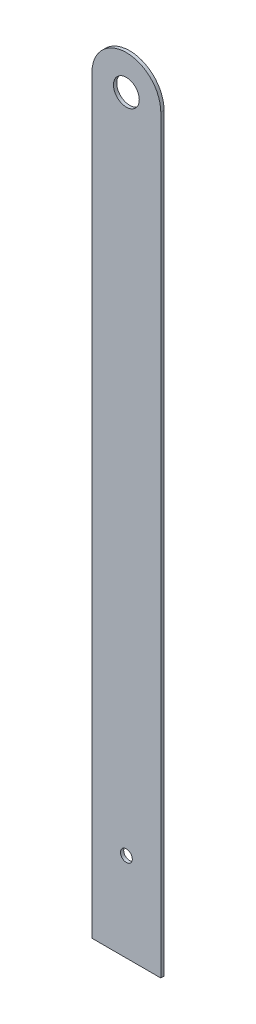
ISO-10303-21;
HEADER;
FILE_DESCRIPTION(('STEP AP214'),'2;1');
FILE_NAME('part.step','',(''),(''),'','','');
FILE_SCHEMA(('AUTOMOTIVE_DESIGN { 1 0 10303 214 1 1 1 1 }'));
ENDSEC;
DATA;
#1=APPLICATION_CONTEXT('core data for automotive mechanical design processes');
#2=APPLICATION_PROTOCOL_DEFINITION('international standard','automotive_design',2000,#1);
#3=PRODUCT_CONTEXT('',#1,'mechanical');
#4=PRODUCT('Part','Part','',(#3));
#5=PRODUCT_RELATED_PRODUCT_CATEGORY('part','',(#4));
#6=PRODUCT_DEFINITION_FORMATION('','',#4);
#7=PRODUCT_DEFINITION_CONTEXT('part definition',#1,'design');
#8=PRODUCT_DEFINITION('design','',#6,#7);
#9=PRODUCT_DEFINITION_SHAPE('','',#8);
#10=(LENGTH_UNIT() NAMED_UNIT(*) SI_UNIT(.MILLI.,.METRE.));
#11=(NAMED_UNIT(*) PLANE_ANGLE_UNIT() SI_UNIT($,.RADIAN.));
#12=(NAMED_UNIT(*) SI_UNIT($,.STERADIAN.) SOLID_ANGLE_UNIT());
#13=UNCERTAINTY_MEASURE_WITH_UNIT(LENGTH_MEASURE(1.E-05),#10,'distance_accuracy_value','');
#14=(GEOMETRIC_REPRESENTATION_CONTEXT(3) GLOBAL_UNCERTAINTY_ASSIGNED_CONTEXT((#13)) GLOBAL_UNIT_ASSIGNED_CONTEXT((#10,
#11,#12)) REPRESENTATION_CONTEXT('',''));
#15=CARTESIAN_POINT('',(0.,0.,0.));
#16=DIRECTION('',(0.,0.,1.));
#17=DIRECTION('',(1.,0.,0.));
#18=AXIS2_PLACEMENT_3D('',#15,#16,#17);
#19=CARTESIAN_POINT('',(12.7,0.,1.2));
#20=DIRECTION('',(1.,0.,0.));
#21=DIRECTION('',(0.,1.,0.));
#22=AXIS2_PLACEMENT_3D('',#19,#20,#21);
#23=PLANE('',#22);
#24=DIRECTION('',(0.,-1.,0.));
#25=VECTOR('',#24,1.);
#26=CARTESIAN_POINT('',(12.7,0.,0.));
#27=LINE('',#26,#25);
#28=CARTESIAN_POINT('',(12.7,138.43,0.));
#29=VERTEX_POINT('',#28);
#30=CARTESIAN_POINT('',(12.7,-138.43,0.));
#31=VERTEX_POINT('',#30);
#32=EDGE_CURVE('E99',#29,#31,#27,.T.);
#33=ORIENTED_EDGE('',*,*,#32,.F.);
#34=DIRECTION('',(0.,0.,-1.));
#35=VECTOR('',#34,1.);
#36=CARTESIAN_POINT('',(12.7,138.43,1.2));
#37=LINE('',#36,#35);
#38=CARTESIAN_POINT('',(12.7,138.43,1.2));
#39=VERTEX_POINT('',#38);
#40=EDGE_CURVE('E11',#39,#29,#37,.T.);
#41=ORIENTED_EDGE('',*,*,#40,.F.);
#42=DIRECTION('',(0.,-1.,0.));
#43=VECTOR('',#42,1.);
#44=CARTESIAN_POINT('',(12.7,0.,1.2));
#45=LINE('',#44,#43);
#46=CARTESIAN_POINT('',(12.7,-138.43,1.2));
#47=VERTEX_POINT('',#46);
#48=EDGE_CURVE('E92',#39,#47,#45,.T.);
#49=ORIENTED_EDGE('',*,*,#48,.T.);
#50=DIRECTION('',(0.,0.,-1.));
#51=VECTOR('',#50,1.);
#52=CARTESIAN_POINT('',(12.7,-138.43,1.2));
#53=LINE('',#52,#51);
#54=EDGE_CURVE('E73',#47,#31,#53,.T.);
#55=ORIENTED_EDGE('',*,*,#54,.T.);
#56=EDGE_LOOP('',(#33,#41,#49,#55));
#57=FACE_BOUND('',#56,.T.);
#58=ADVANCED_FACE('F35',(#57),#23,.T.);
#59=CARTESIAN_POINT('',(0.,138.43,1.2));
#60=DIRECTION('',(0.,0.,-1.));
#61=DIRECTION('',(-1.,0.,0.));
#62=AXIS2_PLACEMENT_3D('',#59,#60,#61);
#63=CYLINDRICAL_SURFACE('',#62,12.7);
#64=CARTESIAN_POINT('',(0.,138.43,0.));
#65=DIRECTION('',(0.,0.,1.));
#66=DIRECTION('',(1.,0.,0.));
#67=AXIS2_PLACEMENT_3D('',#64,#65,#66);
#68=CIRCLE('',#67,12.7);
#69=CARTESIAN_POINT('',(-12.7,138.43,0.));
#70=VERTEX_POINT('',#69);
#71=EDGE_CURVE('E86',#70,#29,#68,.F.);
#72=ORIENTED_EDGE('',*,*,#71,.F.);
#73=DIRECTION('',(0.,0.,-1.));
#74=VECTOR('',#73,1.);
#75=CARTESIAN_POINT('',(-12.7,138.43,1.2));
#76=LINE('',#75,#74);
#77=CARTESIAN_POINT('',(-12.7,138.43,1.2));
#78=VERTEX_POINT('',#77);
#79=EDGE_CURVE('E43',#78,#70,#76,.T.);
#80=ORIENTED_EDGE('',*,*,#79,.F.);
#81=CARTESIAN_POINT('',(0.,138.43,1.2));
#82=DIRECTION('',(0.,0.,1.));
#83=DIRECTION('',(1.,0.,0.));
#84=AXIS2_PLACEMENT_3D('',#81,#82,#83);
#85=CIRCLE('',#84,12.7);
#86=EDGE_CURVE('E84',#78,#39,#85,.F.);
#87=ORIENTED_EDGE('',*,*,#86,.T.);
#88=ORIENTED_EDGE('',*,*,#40,.T.);
#89=EDGE_LOOP('',(#72,#80,#87,#88));
#90=FACE_BOUND('',#89,.T.);
#91=ADVANCED_FACE('F82',(#90),#63,.T.);
#92=CARTESIAN_POINT('',(-12.7,0.,1.2));
#93=DIRECTION('',(1.,0.,0.));
#94=DIRECTION('',(0.,1.,0.));
#95=AXIS2_PLACEMENT_3D('',#92,#93,#94);
#96=PLANE('',#95);
#97=DIRECTION('',(0.,-1.,0.));
#98=VECTOR('',#97,1.);
#99=CARTESIAN_POINT('',(-12.7,0.,0.));
#100=LINE('',#99,#98);
#101=CARTESIAN_POINT('',(-12.7,-138.43,0.));
#102=VERTEX_POINT('',#101);
#103=EDGE_CURVE('E66',#70,#102,#100,.T.);
#104=ORIENTED_EDGE('',*,*,#103,.T.);
#105=DIRECTION('',(0.,0.,-1.));
#106=VECTOR('',#105,1.);
#107=CARTESIAN_POINT('',(-12.7,-138.43,1.2));
#108=LINE('',#107,#106);
#109=CARTESIAN_POINT('',(-12.7,-138.43,1.2));
#110=VERTEX_POINT('',#109);
#111=EDGE_CURVE('E87',#110,#102,#108,.T.);
#112=ORIENTED_EDGE('',*,*,#111,.F.);
#113=DIRECTION('',(0.,-1.,0.));
#114=VECTOR('',#113,1.);
#115=CARTESIAN_POINT('',(-12.7,0.,1.2));
#116=LINE('',#115,#114);
#117=EDGE_CURVE('E88',#78,#110,#116,.T.);
#118=ORIENTED_EDGE('',*,*,#117,.F.);
#119=ORIENTED_EDGE('',*,*,#79,.T.);
#120=EDGE_LOOP('',(#104,#112,#118,#119));
#121=FACE_BOUND('',#120,.T.);
#122=ADVANCED_FACE('F89',(#121),#96,.F.);
#123=CARTESIAN_POINT('',(0.,-138.43,1.2));
#124=DIRECTION('',(0.,1.,0.));
#125=DIRECTION('',(0.,0.,1.));
#126=AXIS2_PLACEMENT_3D('',#123,#124,#125);
#127=PLANE('',#126);
#128=DIRECTION('',(1.,0.,0.));
#129=VECTOR('',#128,1.);
#130=CARTESIAN_POINT('',(0.,-138.43,0.));
#131=LINE('',#130,#129);
#132=EDGE_CURVE('E94',#102,#31,#131,.T.);
#133=ORIENTED_EDGE('',*,*,#132,.T.);
#134=ORIENTED_EDGE('',*,*,#54,.F.);
#135=DIRECTION('',(1.,0.,0.));
#136=VECTOR('',#135,1.);
#137=CARTESIAN_POINT('',(0.,-138.43,1.2));
#138=LINE('',#137,#136);
#139=EDGE_CURVE('E51',#110,#47,#138,.T.);
#140=ORIENTED_EDGE('',*,*,#139,.F.);
#141=ORIENTED_EDGE('',*,*,#111,.T.);
#142=EDGE_LOOP('',(#133,#134,#140,#141));
#143=FACE_BOUND('',#142,.T.);
#144=ADVANCED_FACE('F109',(#143),#127,.F.);
#145=CARTESIAN_POINT('',(0.,0.,1.2));
#146=DIRECTION('',(0.,0.,1.));
#147=DIRECTION('',(1.,0.,0.));
#148=AXIS2_PLACEMENT_3D('',#145,#146,#147);
#149=PLANE('',#148);
#150=CARTESIAN_POINT('',(0.,-105.668572,1.2));
#151=DIRECTION('',(0.,0.,1.));
#152=DIRECTION('',(1.,0.,0.));
#153=AXIS2_PLACEMENT_3D('',#150,#151,#152);
#154=CIRCLE('',#153,2.1827998);
#155=CARTESIAN_POINT('',(2.1827998,-105.668572,1.2));
#156=VERTEX_POINT('',#155);
#157=EDGE_CURVE('E144',#156,#156,#154,.T.);
#158=ORIENTED_EDGE('',*,*,#157,.F.);
#159=EDGE_LOOP('',(#158));
#160=FACE_BOUND('',#159,.T.);
#161=CARTESIAN_POINT('',(0.,138.43,1.2));
#162=DIRECTION('',(0.,0.,1.));
#163=DIRECTION('',(1.,0.,0.));
#164=AXIS2_PLACEMENT_3D('',#161,#162,#163);
#165=CIRCLE('',#164,4.7625);
#166=CARTESIAN_POINT('',(4.76249999999998,138.43,1.2));
#167=VERTEX_POINT('',#166);
#168=EDGE_CURVE('E146',#167,#167,#165,.T.);
#169=ORIENTED_EDGE('',*,*,#168,.F.);
#170=EDGE_LOOP('',(#169));
#171=FACE_BOUND('',#170,.T.);
#172=ORIENTED_EDGE('',*,*,#48,.F.);
#173=ORIENTED_EDGE('',*,*,#86,.F.);
#174=ORIENTED_EDGE('',*,*,#117,.T.);
#175=ORIENTED_EDGE('',*,*,#139,.T.);
#176=EDGE_LOOP('',(#172,#173,#174,#175));
#177=FACE_BOUND('',#176,.T.);
#178=ADVANCED_FACE('F91',(#160,#171,#177),#149,.T.);
#179=CARTESIAN_POINT('',(0.,0.,0.));
#180=DIRECTION('',(0.,0.,1.));
#181=DIRECTION('',(1.,0.,0.));
#182=AXIS2_PLACEMENT_3D('',#179,#180,#181);
#183=PLANE('',#182);
#184=CARTESIAN_POINT('',(0.,-105.668572,0.));
#185=DIRECTION('',(0.,0.,1.));
#186=DIRECTION('',(1.,0.,0.));
#187=AXIS2_PLACEMENT_3D('',#184,#185,#186);
#188=CIRCLE('',#187,2.1827998);
#189=CARTESIAN_POINT('',(2.1827998,-105.668572,0.));
#190=VERTEX_POINT('',#189);
#191=EDGE_CURVE('E141',#190,#190,#188,.T.);
#192=ORIENTED_EDGE('',*,*,#191,.T.);
#193=EDGE_LOOP('',(#192));
#194=FACE_BOUND('',#193,.T.);
#195=CARTESIAN_POINT('',(0.,138.43,0.));
#196=DIRECTION('',(0.,0.,1.));
#197=DIRECTION('',(1.,0.,0.));
#198=AXIS2_PLACEMENT_3D('',#195,#196,#197);
#199=CIRCLE('',#198,4.7625);
#200=CARTESIAN_POINT('',(4.76249999999998,138.43,0.));
#201=VERTEX_POINT('',#200);
#202=EDGE_CURVE('E102',#201,#201,#199,.T.);
#203=ORIENTED_EDGE('',*,*,#202,.T.);
#204=EDGE_LOOP('',(#203));
#205=FACE_BOUND('',#204,.T.);
#206=ORIENTED_EDGE('',*,*,#32,.T.);
#207=ORIENTED_EDGE('',*,*,#132,.F.);
#208=ORIENTED_EDGE('',*,*,#103,.F.);
#209=ORIENTED_EDGE('',*,*,#71,.T.);
#210=EDGE_LOOP('',(#206,#207,#208,#209));
#211=FACE_BOUND('',#210,.T.);
#212=ADVANCED_FACE('F111',(#194,#205,#211),#183,.F.);
#213=CARTESIAN_POINT('',(0.,138.43,0.));
#214=DIRECTION('',(0.,0.,1.));
#215=DIRECTION('',(1.,0.,0.));
#216=AXIS2_PLACEMENT_3D('',#213,#214,#215);
#217=CYLINDRICAL_SURFACE('',#216,4.7625);
#218=ORIENTED_EDGE('',*,*,#202,.F.);
#219=EDGE_LOOP('',(#218));
#220=FACE_BOUND('',#219,.T.);
#221=ORIENTED_EDGE('',*,*,#168,.T.);
#222=EDGE_LOOP('',(#221));
#223=FACE_BOUND('',#222,.T.);
#224=ADVANCED_FACE('F125',(#220,#223),#217,.F.);
#225=CARTESIAN_POINT('',(0.,-105.668572,0.));
#226=DIRECTION('',(0.,0.,1.));
#227=DIRECTION('',(1.,0.,0.));
#228=AXIS2_PLACEMENT_3D('',#225,#226,#227);
#229=CYLINDRICAL_SURFACE('',#228,2.1827998);
#230=ORIENTED_EDGE('',*,*,#191,.F.);
#231=EDGE_LOOP('',(#230));
#232=FACE_BOUND('',#231,.T.);
#233=ORIENTED_EDGE('',*,*,#157,.T.);
#234=EDGE_LOOP('',(#233));
#235=FACE_BOUND('',#234,.T.);
#236=ADVANCED_FACE('F132',(#232,#235),#229,.F.);
#237=CLOSED_SHELL('',(#58,#91,#122,#144,#178,#212,#224,#236));
#238=MANIFOLD_SOLID_BREP('B2',#237);
#239=ADVANCED_BREP_SHAPE_REPRESENTATION('',(#18,#238),#14);
#240=SHAPE_DEFINITION_REPRESENTATION(#9,#239);
ENDSEC;
END-ISO-10303-21;
